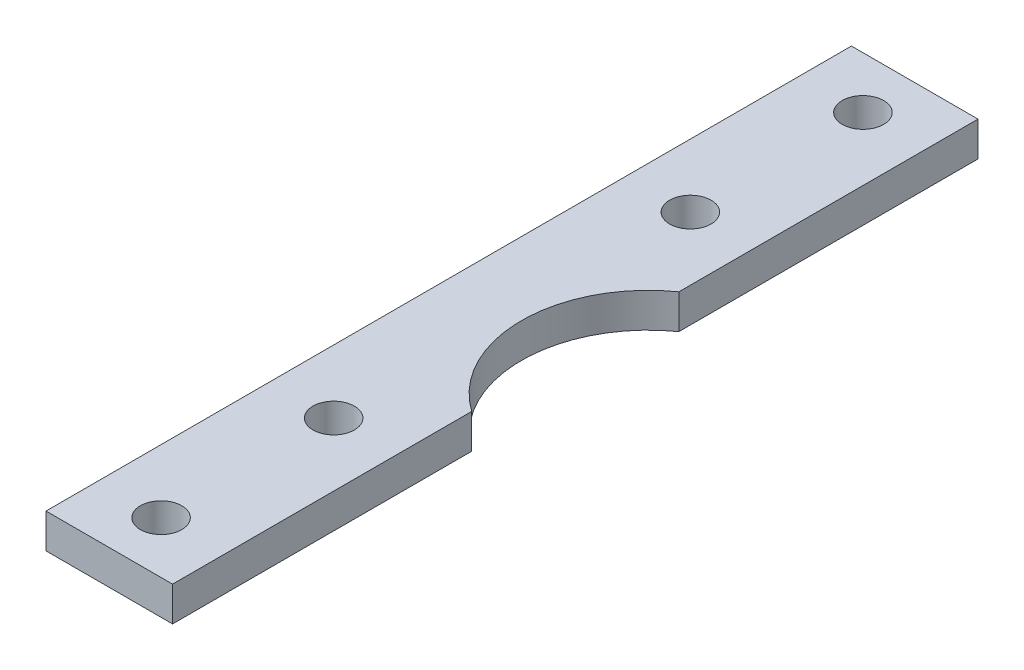
ISO-10303-21;
HEADER;
FILE_DESCRIPTION(('STEP AP214'),'2;1');
FILE_NAME('part.step','',(''),(''),'','','');
FILE_SCHEMA(('AUTOMOTIVE_DESIGN { 1 0 10303 214 1 1 1 1 }'));
ENDSEC;
DATA;
#1=APPLICATION_CONTEXT('core data for automotive mechanical design processes');
#2=APPLICATION_PROTOCOL_DEFINITION('international standard','automotive_design',2000,#1);
#3=PRODUCT_CONTEXT('',#1,'mechanical');
#4=PRODUCT('Part','Part','',(#3));
#5=PRODUCT_RELATED_PRODUCT_CATEGORY('part','',(#4));
#6=PRODUCT_DEFINITION_FORMATION('','',#4);
#7=PRODUCT_DEFINITION_CONTEXT('part definition',#1,'design');
#8=PRODUCT_DEFINITION('design','',#6,#7);
#9=PRODUCT_DEFINITION_SHAPE('','',#8);
#10=(LENGTH_UNIT() NAMED_UNIT(*) SI_UNIT(.MILLI.,.METRE.));
#11=(NAMED_UNIT(*) PLANE_ANGLE_UNIT() SI_UNIT($,.RADIAN.));
#12=(NAMED_UNIT(*) SI_UNIT($,.STERADIAN.) SOLID_ANGLE_UNIT());
#13=UNCERTAINTY_MEASURE_WITH_UNIT(LENGTH_MEASURE(1.E-05),#10,'distance_accuracy_value','');
#14=(GEOMETRIC_REPRESENTATION_CONTEXT(3) GLOBAL_UNCERTAINTY_ASSIGNED_CONTEXT((#13)) GLOBAL_UNIT_ASSIGNED_CONTEXT((#10,
#11,#12)) REPRESENTATION_CONTEXT('',''));
#15=CARTESIAN_POINT('',(0.,0.,0.));
#16=DIRECTION('',(0.,0.,1.));
#17=DIRECTION('',(1.,0.,0.));
#18=AXIS2_PLACEMENT_3D('',#15,#16,#17);
#19=CARTESIAN_POINT('',(17.3245553203368,3.,-35.));
#20=DIRECTION('',(0.,-1.,0.));
#21=DIRECTION('',(0.,0.,-1.));
#22=AXIS2_PLACEMENT_3D('',#19,#20,#21);
#23=PLANE('',#22);
#24=DIRECTION('',(0.,0.,1.));
#25=VECTOR('',#24,1.);
#26=CARTESIAN_POINT('',(0.,3.,0.));
#27=LINE('',#26,#25);
#28=CARTESIAN_POINT('',(0.,3.,-70.));
#29=VERTEX_POINT('',#28);
#30=CARTESIAN_POINT('',(0.,3.,0.));
#31=VERTEX_POINT('',#30);
#32=EDGE_CURVE('E129',#29,#31,#27,.T.);
#33=ORIENTED_EDGE('',*,*,#32,.T.);
#34=DIRECTION('',(1.,0.,0.));
#35=VECTOR('',#34,1.);
#36=CARTESIAN_POINT('',(0.,3.,0.));
#37=LINE('',#36,#35);
#38=CARTESIAN_POINT('',(11.,3.,0.));
#39=VERTEX_POINT('',#38);
#40=EDGE_CURVE('E87',#31,#39,#37,.T.);
#41=ORIENTED_EDGE('',*,*,#40,.T.);
#42=DIRECTION('',(0.,0.,-1.));
#43=VECTOR('',#42,1.);
#44=CARTESIAN_POINT('',(11.,3.,0.));
#45=LINE('',#44,#43);
#46=CARTESIAN_POINT('',(11.,3.,-26.));
#47=VERTEX_POINT('',#46);
#48=EDGE_CURVE('E100',#39,#47,#45,.T.);
#49=ORIENTED_EDGE('',*,*,#48,.T.);
#50=CARTESIAN_POINT('',(17.3245553203368,3.,-35.));
#51=DIRECTION('',(0.,-1.,0.));
#52=DIRECTION('',(0.,0.,-1.));
#53=AXIS2_PLACEMENT_3D('',#50,#51,#52);
#54=CIRCLE('',#53,11.);
#55=CARTESIAN_POINT('',(11.,3.,-44.));
#56=VERTEX_POINT('',#55);
#57=EDGE_CURVE('E94',#47,#56,#54,.T.);
#58=ORIENTED_EDGE('',*,*,#57,.T.);
#59=DIRECTION('',(0.,0.,-1.));
#60=VECTOR('',#59,1.);
#61=CARTESIAN_POINT('',(11.,3.,-44.));
#62=LINE('',#61,#60);
#63=CARTESIAN_POINT('',(11.,3.,-70.));
#64=VERTEX_POINT('',#63);
#65=EDGE_CURVE('E98',#56,#64,#62,.T.);
#66=ORIENTED_EDGE('',*,*,#65,.T.);
#67=DIRECTION('',(-1.,0.,0.));
#68=VECTOR('',#67,1.);
#69=CARTESIAN_POINT('',(0.,3.,-70.));
#70=LINE('',#69,#68);
#71=EDGE_CURVE('E50',#64,#29,#70,.T.);
#72=ORIENTED_EDGE('',*,*,#71,.T.);
#73=EDGE_LOOP('',(#33,#41,#49,#58,#66,#72));
#74=FACE_BOUND('',#73,.T.);
#75=CARTESIAN_POINT('',(5.5,3.,-65.5));
#76=DIRECTION('',(0.,1.,0.));
#77=DIRECTION('',(0.,0.,1.));
#78=AXIS2_PLACEMENT_3D('',#75,#76,#77);
#79=CIRCLE('',#78,1.8);
#80=CARTESIAN_POINT('',(5.5,3.,-63.7));
#81=VERTEX_POINT('',#80);
#82=EDGE_CURVE('E122',#81,#81,#79,.T.);
#83=ORIENTED_EDGE('',*,*,#82,.F.);
#84=EDGE_LOOP('',(#83));
#85=FACE_BOUND('',#84,.T.);
#86=CARTESIAN_POINT('',(5.5,3.,-4.5));
#87=DIRECTION('',(0.,1.,0.));
#88=DIRECTION('',(0.,0.,1.));
#89=AXIS2_PLACEMENT_3D('',#86,#87,#88);
#90=CIRCLE('',#89,1.8);
#91=CARTESIAN_POINT('',(5.5,3.,-2.7));
#92=VERTEX_POINT('',#91);
#93=EDGE_CURVE('E193',#92,#92,#90,.T.);
#94=ORIENTED_EDGE('',*,*,#93,.F.);
#95=EDGE_LOOP('',(#94));
#96=FACE_BOUND('',#95,.T.);
#97=CARTESIAN_POINT('',(5.5,3.,-50.5));
#98=DIRECTION('',(0.,1.,0.));
#99=DIRECTION('',(0.,0.,1.));
#100=AXIS2_PLACEMENT_3D('',#97,#98,#99);
#101=CIRCLE('',#100,1.8);
#102=CARTESIAN_POINT('',(5.5,3.,-48.7));
#103=VERTEX_POINT('',#102);
#104=EDGE_CURVE('E187',#103,#103,#101,.T.);
#105=ORIENTED_EDGE('',*,*,#104,.F.);
#106=EDGE_LOOP('',(#105));
#107=FACE_BOUND('',#106,.T.);
#108=CARTESIAN_POINT('',(5.5,3.,-19.5));
#109=DIRECTION('',(0.,1.,0.));
#110=DIRECTION('',(0.,0.,1.));
#111=AXIS2_PLACEMENT_3D('',#108,#109,#110);
#112=CIRCLE('',#111,1.8);
#113=CARTESIAN_POINT('',(5.5,3.,-17.7));
#114=VERTEX_POINT('',#113);
#115=EDGE_CURVE('E178',#114,#114,#112,.T.);
#116=ORIENTED_EDGE('',*,*,#115,.F.);
#117=EDGE_LOOP('',(#116));
#118=FACE_BOUND('',#117,.T.);
#119=ADVANCED_FACE('F33',(#74,#85,#96,#107,#118),#23,.F.);
#120=CARTESIAN_POINT('',(17.3245553203368,0.,-35.));
#121=DIRECTION('',(0.,-1.,0.));
#122=DIRECTION('',(0.,0.,-1.));
#123=AXIS2_PLACEMENT_3D('',#120,#121,#122);
#124=PLANE('',#123);
#125=CARTESIAN_POINT('',(5.5,0.,-50.5));
#126=DIRECTION('',(0.,1.,0.));
#127=DIRECTION('',(0.,0.,1.));
#128=AXIS2_PLACEMENT_3D('',#125,#126,#127);
#129=CIRCLE('',#128,1.8);
#130=CARTESIAN_POINT('',(5.5,0.,-48.7));
#131=VERTEX_POINT('',#130);
#132=EDGE_CURVE('E184',#131,#131,#129,.T.);
#133=ORIENTED_EDGE('',*,*,#132,.T.);
#134=EDGE_LOOP('',(#133));
#135=FACE_BOUND('',#134,.T.);
#136=CARTESIAN_POINT('',(5.5,0.,-65.5));
#137=DIRECTION('',(0.,1.,0.));
#138=DIRECTION('',(0.,0.,1.));
#139=AXIS2_PLACEMENT_3D('',#136,#137,#138);
#140=CIRCLE('',#139,1.8);
#141=CARTESIAN_POINT('',(5.5,0.,-63.7));
#142=VERTEX_POINT('',#141);
#143=EDGE_CURVE('E196',#142,#142,#140,.T.);
#144=ORIENTED_EDGE('',*,*,#143,.T.);
#145=EDGE_LOOP('',(#144));
#146=FACE_BOUND('',#145,.T.);
#147=DIRECTION('',(0.,0.,1.));
#148=VECTOR('',#147,1.);
#149=CARTESIAN_POINT('',(0.,0.,0.));
#150=LINE('',#149,#148);
#151=CARTESIAN_POINT('',(0.,0.,-70.));
#152=VERTEX_POINT('',#151);
#153=CARTESIAN_POINT('',(0.,0.,0.));
#154=VERTEX_POINT('',#153);
#155=EDGE_CURVE('E118',#152,#154,#150,.T.);
#156=ORIENTED_EDGE('',*,*,#155,.F.);
#157=DIRECTION('',(-1.,0.,0.));
#158=VECTOR('',#157,1.);
#159=CARTESIAN_POINT('',(0.,0.,-70.));
#160=LINE('',#159,#158);
#161=CARTESIAN_POINT('',(11.,0.,-70.));
#162=VERTEX_POINT('',#161);
#163=EDGE_CURVE('E79',#162,#152,#160,.T.);
#164=ORIENTED_EDGE('',*,*,#163,.F.);
#165=DIRECTION('',(0.,0.,-1.));
#166=VECTOR('',#165,1.);
#167=CARTESIAN_POINT('',(11.,0.,-44.));
#168=LINE('',#167,#166);
#169=CARTESIAN_POINT('',(11.,0.,-44.));
#170=VERTEX_POINT('',#169);
#171=EDGE_CURVE('E73',#170,#162,#168,.T.);
#172=ORIENTED_EDGE('',*,*,#171,.F.);
#173=CARTESIAN_POINT('',(17.3245553203368,0.,-35.));
#174=DIRECTION('',(0.,-1.,0.));
#175=DIRECTION('',(0.,0.,-1.));
#176=AXIS2_PLACEMENT_3D('',#173,#174,#175);
#177=CIRCLE('',#176,11.);
#178=CARTESIAN_POINT('',(11.,0.,-26.));
#179=VERTEX_POINT('',#178);
#180=EDGE_CURVE('E108',#179,#170,#177,.T.);
#181=ORIENTED_EDGE('',*,*,#180,.F.);
#182=DIRECTION('',(0.,0.,-1.));
#183=VECTOR('',#182,1.);
#184=CARTESIAN_POINT('',(11.,0.,0.));
#185=LINE('',#184,#183);
#186=CARTESIAN_POINT('',(11.,0.,0.));
#187=VERTEX_POINT('',#186);
#188=EDGE_CURVE('E124',#187,#179,#185,.T.);
#189=ORIENTED_EDGE('',*,*,#188,.F.);
#190=DIRECTION('',(1.,0.,0.));
#191=VECTOR('',#190,1.);
#192=CARTESIAN_POINT('',(0.,0.,0.));
#193=LINE('',#192,#191);
#194=EDGE_CURVE('E121',#154,#187,#193,.T.);
#195=ORIENTED_EDGE('',*,*,#194,.F.);
#196=EDGE_LOOP('',(#156,#164,#172,#181,#189,#195));
#197=FACE_BOUND('',#196,.T.);
#198=CARTESIAN_POINT('',(5.5,0.,-4.5));
#199=DIRECTION('',(0.,1.,0.));
#200=DIRECTION('',(0.,0.,1.));
#201=AXIS2_PLACEMENT_3D('',#198,#199,#200);
#202=CIRCLE('',#201,1.8);
#203=CARTESIAN_POINT('',(5.5,0.,-2.7));
#204=VERTEX_POINT('',#203);
#205=EDGE_CURVE('E190',#204,#204,#202,.T.);
#206=ORIENTED_EDGE('',*,*,#205,.T.);
#207=EDGE_LOOP('',(#206));
#208=FACE_BOUND('',#207,.T.);
#209=CARTESIAN_POINT('',(5.5,0.,-19.5));
#210=DIRECTION('',(0.,1.,0.));
#211=DIRECTION('',(0.,0.,1.));
#212=AXIS2_PLACEMENT_3D('',#209,#210,#211);
#213=CIRCLE('',#212,1.8);
#214=CARTESIAN_POINT('',(5.5,0.,-17.7));
#215=VERTEX_POINT('',#214);
#216=EDGE_CURVE('E181',#215,#215,#213,.T.);
#217=ORIENTED_EDGE('',*,*,#216,.T.);
#218=EDGE_LOOP('',(#217));
#219=FACE_BOUND('',#218,.T.);
#220=ADVANCED_FACE('F138',(#135,#146,#197,#208,#219),#124,.T.);
#221=CARTESIAN_POINT('',(0.,3.,0.));
#222=DIRECTION('',(1.,0.,0.));
#223=DIRECTION('',(0.,0.,-1.));
#224=AXIS2_PLACEMENT_3D('',#221,#222,#223);
#225=PLANE('',#224);
#226=ORIENTED_EDGE('',*,*,#155,.T.);
#227=DIRECTION('',(0.,-1.,0.));
#228=VECTOR('',#227,1.);
#229=CARTESIAN_POINT('',(0.,3.,0.));
#230=LINE('',#229,#228);
#231=EDGE_CURVE('E11',#31,#154,#230,.T.);
#232=ORIENTED_EDGE('',*,*,#231,.F.);
#233=ORIENTED_EDGE('',*,*,#32,.F.);
#234=DIRECTION('',(0.,-1.,0.));
#235=VECTOR('',#234,1.);
#236=CARTESIAN_POINT('',(0.,3.,-70.));
#237=LINE('',#236,#235);
#238=EDGE_CURVE('E114',#29,#152,#237,.T.);
#239=ORIENTED_EDGE('',*,*,#238,.T.);
#240=EDGE_LOOP('',(#226,#232,#233,#239));
#241=FACE_BOUND('',#240,.T.);
#242=ADVANCED_FACE('F35',(#241),#225,.F.);
#243=CARTESIAN_POINT('',(0.,3.,0.));
#244=DIRECTION('',(0.,0.,-1.));
#245=DIRECTION('',(-1.,0.,0.));
#246=AXIS2_PLACEMENT_3D('',#243,#244,#245);
#247=PLANE('',#246);
#248=ORIENTED_EDGE('',*,*,#194,.T.);
#249=DIRECTION('',(0.,-1.,0.));
#250=VECTOR('',#249,1.);
#251=CARTESIAN_POINT('',(11.,3.,0.));
#252=LINE('',#251,#250);
#253=EDGE_CURVE('E42',#39,#187,#252,.T.);
#254=ORIENTED_EDGE('',*,*,#253,.F.);
#255=ORIENTED_EDGE('',*,*,#40,.F.);
#256=ORIENTED_EDGE('',*,*,#231,.T.);
#257=EDGE_LOOP('',(#248,#254,#255,#256));
#258=FACE_BOUND('',#257,.T.);
#259=ADVANCED_FACE('F256',(#258),#247,.F.);
#260=CARTESIAN_POINT('',(11.,3.,0.));
#261=DIRECTION('',(-1.,0.,0.));
#262=DIRECTION('',(0.,0.,1.));
#263=AXIS2_PLACEMENT_3D('',#260,#261,#262);
#264=PLANE('',#263);
#265=ORIENTED_EDGE('',*,*,#188,.T.);
#266=DIRECTION('',(0.,-1.,0.));
#267=VECTOR('',#266,1.);
#268=CARTESIAN_POINT('',(11.,3.,-26.));
#269=LINE('',#268,#267);
#270=EDGE_CURVE('E109',#47,#179,#269,.T.);
#271=ORIENTED_EDGE('',*,*,#270,.F.);
#272=ORIENTED_EDGE('',*,*,#48,.F.);
#273=ORIENTED_EDGE('',*,*,#253,.T.);
#274=EDGE_LOOP('',(#265,#271,#272,#273));
#275=FACE_BOUND('',#274,.T.);
#276=ADVANCED_FACE('F135',(#275),#264,.F.);
#277=CARTESIAN_POINT('',(17.3245553203368,3.,-35.));
#278=DIRECTION('',(0.,-1.,0.));
#279=DIRECTION('',(0.,0.,-1.));
#280=AXIS2_PLACEMENT_3D('',#277,#278,#279);
#281=CYLINDRICAL_SURFACE('',#280,11.);
#282=ORIENTED_EDGE('',*,*,#180,.T.);
#283=DIRECTION('',(0.,-1.,0.));
#284=VECTOR('',#283,1.);
#285=CARTESIAN_POINT('',(11.,3.,-44.));
#286=LINE('',#285,#284);
#287=EDGE_CURVE('E105',#56,#170,#286,.T.);
#288=ORIENTED_EDGE('',*,*,#287,.F.);
#289=ORIENTED_EDGE('',*,*,#57,.F.);
#290=ORIENTED_EDGE('',*,*,#270,.T.);
#291=EDGE_LOOP('',(#282,#288,#289,#290));
#292=FACE_BOUND('',#291,.T.);
#293=ADVANCED_FACE('F106',(#292),#281,.F.);
#294=CARTESIAN_POINT('',(11.,3.,-44.));
#295=DIRECTION('',(-1.,0.,0.));
#296=DIRECTION('',(0.,0.,1.));
#297=AXIS2_PLACEMENT_3D('',#294,#295,#296);
#298=PLANE('',#297);
#299=ORIENTED_EDGE('',*,*,#171,.T.);
#300=DIRECTION('',(0.,-1.,0.));
#301=VECTOR('',#300,1.);
#302=CARTESIAN_POINT('',(11.,3.,-70.));
#303=LINE('',#302,#301);
#304=EDGE_CURVE('E110',#64,#162,#303,.T.);
#305=ORIENTED_EDGE('',*,*,#304,.F.);
#306=ORIENTED_EDGE('',*,*,#65,.F.);
#307=ORIENTED_EDGE('',*,*,#287,.T.);
#308=EDGE_LOOP('',(#299,#305,#306,#307));
#309=FACE_BOUND('',#308,.T.);
#310=ADVANCED_FACE('F112',(#309),#298,.F.);
#311=CARTESIAN_POINT('',(0.,3.,-70.));
#312=DIRECTION('',(0.,0.,1.));
#313=DIRECTION('',(1.,0.,0.));
#314=AXIS2_PLACEMENT_3D('',#311,#312,#313);
#315=PLANE('',#314);
#316=ORIENTED_EDGE('',*,*,#163,.T.);
#317=ORIENTED_EDGE('',*,*,#238,.F.);
#318=ORIENTED_EDGE('',*,*,#71,.F.);
#319=ORIENTED_EDGE('',*,*,#304,.T.);
#320=EDGE_LOOP('',(#316,#317,#318,#319));
#321=FACE_BOUND('',#320,.T.);
#322=ADVANCED_FACE('F143',(#321),#315,.F.);
#323=CARTESIAN_POINT('',(5.5,3.,-65.5));
#324=DIRECTION('',(0.,-1.,0.));
#325=DIRECTION('',(0.,0.,-1.));
#326=AXIS2_PLACEMENT_3D('',#323,#324,#325);
#327=CYLINDRICAL_SURFACE('',#326,1.8);
#328=ORIENTED_EDGE('',*,*,#82,.T.);
#329=EDGE_LOOP('',(#328));
#330=FACE_BOUND('',#329,.T.);
#331=ORIENTED_EDGE('',*,*,#143,.F.);
#332=EDGE_LOOP('',(#331));
#333=FACE_BOUND('',#332,.T.);
#334=ADVANCED_FACE('F145',(#330,#333),#327,.F.);
#335=CARTESIAN_POINT('',(5.5,3.,-4.5));
#336=DIRECTION('',(0.,-1.,0.));
#337=DIRECTION('',(0.,0.,-1.));
#338=AXIS2_PLACEMENT_3D('',#335,#336,#337);
#339=CYLINDRICAL_SURFACE('',#338,1.8);
#340=ORIENTED_EDGE('',*,*,#93,.T.);
#341=EDGE_LOOP('',(#340));
#342=FACE_BOUND('',#341,.T.);
#343=ORIENTED_EDGE('',*,*,#205,.F.);
#344=EDGE_LOOP('',(#343));
#345=FACE_BOUND('',#344,.T.);
#346=ADVANCED_FACE('F151',(#342,#345),#339,.F.);
#347=CARTESIAN_POINT('',(5.5,3.,-50.5));
#348=DIRECTION('',(0.,-1.,0.));
#349=DIRECTION('',(0.,0.,-1.));
#350=AXIS2_PLACEMENT_3D('',#347,#348,#349);
#351=CYLINDRICAL_SURFACE('',#350,1.8);
#352=ORIENTED_EDGE('',*,*,#104,.T.);
#353=EDGE_LOOP('',(#352));
#354=FACE_BOUND('',#353,.T.);
#355=ORIENTED_EDGE('',*,*,#132,.F.);
#356=EDGE_LOOP('',(#355));
#357=FACE_BOUND('',#356,.T.);
#358=ADVANCED_FACE('F165',(#354,#357),#351,.F.);
#359=CARTESIAN_POINT('',(5.5,3.,-19.5));
#360=DIRECTION('',(0.,-1.,0.));
#361=DIRECTION('',(0.,0.,-1.));
#362=AXIS2_PLACEMENT_3D('',#359,#360,#361);
#363=CYLINDRICAL_SURFACE('',#362,1.8);
#364=ORIENTED_EDGE('',*,*,#115,.T.);
#365=EDGE_LOOP('',(#364));
#366=FACE_BOUND('',#365,.T.);
#367=ORIENTED_EDGE('',*,*,#216,.F.);
#368=EDGE_LOOP('',(#367));
#369=FACE_BOUND('',#368,.T.);
#370=ADVANCED_FACE('F169',(#366,#369),#363,.F.);
#371=CLOSED_SHELL('',(#119,#220,#242,#259,#276,#293,#310,#322,#334,#346,#358,#370));
#372=MANIFOLD_SOLID_BREP('B2',#371);
#373=ADVANCED_BREP_SHAPE_REPRESENTATION('',(#18,#372),#14);
#374=SHAPE_DEFINITION_REPRESENTATION(#9,#373);
ENDSEC;
END-ISO-10303-21;
